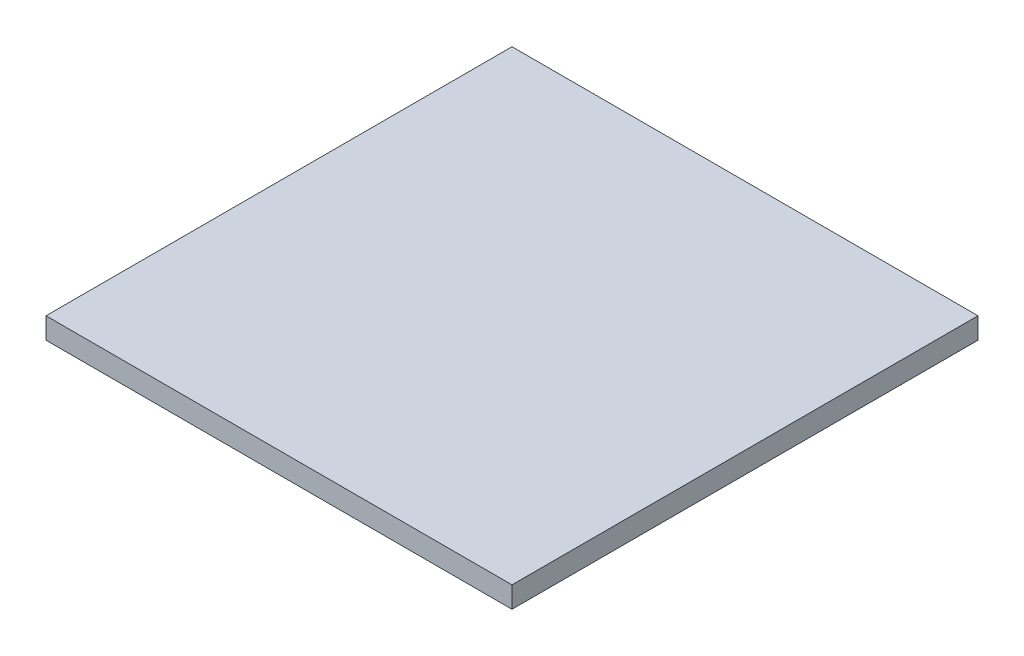
ISO-10303-21;
HEADER;
FILE_DESCRIPTION(('STEP AP214'),'2;1');
FILE_NAME('part.step','',(''),(''),'','','');
FILE_SCHEMA(('AUTOMOTIVE_DESIGN { 1 0 10303 214 1 1 1 1 }'));
ENDSEC;
DATA;
#1=APPLICATION_CONTEXT('core data for automotive mechanical design processes');
#2=APPLICATION_PROTOCOL_DEFINITION('international standard','automotive_design',2000,#1);
#3=PRODUCT_CONTEXT('',#1,'mechanical');
#4=PRODUCT('Part','Part','',(#3));
#5=PRODUCT_RELATED_PRODUCT_CATEGORY('part','',(#4));
#6=PRODUCT_DEFINITION_FORMATION('','',#4);
#7=PRODUCT_DEFINITION_CONTEXT('part definition',#1,'design');
#8=PRODUCT_DEFINITION('design','',#6,#7);
#9=PRODUCT_DEFINITION_SHAPE('','',#8);
#10=(LENGTH_UNIT() NAMED_UNIT(*) SI_UNIT(.MILLI.,.METRE.));
#11=(NAMED_UNIT(*) PLANE_ANGLE_UNIT() SI_UNIT($,.RADIAN.));
#12=(NAMED_UNIT(*) SI_UNIT($,.STERADIAN.) SOLID_ANGLE_UNIT());
#13=UNCERTAINTY_MEASURE_WITH_UNIT(LENGTH_MEASURE(1.E-05),#10,'distance_accuracy_value','');
#14=(GEOMETRIC_REPRESENTATION_CONTEXT(3) GLOBAL_UNCERTAINTY_ASSIGNED_CONTEXT((#13)) GLOBAL_UNIT_ASSIGNED_CONTEXT((#10,
#11,#12)) REPRESENTATION_CONTEXT('',''));
#15=CARTESIAN_POINT('',(0.,0.,0.));
#16=DIRECTION('',(0.,0.,1.));
#17=DIRECTION('',(1.,0.,0.));
#18=AXIS2_PLACEMENT_3D('',#15,#16,#17);
#19=CARTESIAN_POINT('',(0.,12.7,0.));
#20=DIRECTION('',(1.,0.,0.));
#21=DIRECTION('',(0.,0.,-1.));
#22=AXIS2_PLACEMENT_3D('',#19,#20,#21);
#23=PLANE('',#22);
#24=DIRECTION('',(0.,0.,1.));
#25=VECTOR('',#24,1.);
#26=CARTESIAN_POINT('',(0.,0.,0.));
#27=LINE('',#26,#25);
#28=CARTESIAN_POINT('',(0.,0.,-279.4));
#29=VERTEX_POINT('',#28);
#30=CARTESIAN_POINT('',(0.,0.,0.));
#31=VERTEX_POINT('',#30);
#32=EDGE_CURVE('E99',#29,#31,#27,.T.);
#33=ORIENTED_EDGE('',*,*,#32,.T.);
#34=DIRECTION('',(0.,-1.,0.));
#35=VECTOR('',#34,1.);
#36=CARTESIAN_POINT('',(0.,12.7,0.));
#37=LINE('',#36,#35);
#38=CARTESIAN_POINT('',(0.,12.7,0.));
#39=VERTEX_POINT('',#38);
#40=EDGE_CURVE('E11',#39,#31,#37,.T.);
#41=ORIENTED_EDGE('',*,*,#40,.F.);
#42=DIRECTION('',(0.,0.,1.));
#43=VECTOR('',#42,1.);
#44=CARTESIAN_POINT('',(0.,12.7,0.));
#45=LINE('',#44,#43);
#46=CARTESIAN_POINT('',(0.,12.7,-279.4));
#47=VERTEX_POINT('',#46);
#48=EDGE_CURVE('E87',#47,#39,#45,.T.);
#49=ORIENTED_EDGE('',*,*,#48,.F.);
#50=DIRECTION('',(0.,-1.,0.));
#51=VECTOR('',#50,1.);
#52=CARTESIAN_POINT('',(0.,12.7,-279.4));
#53=LINE('',#52,#51);
#54=EDGE_CURVE('E95',#47,#29,#53,.T.);
#55=ORIENTED_EDGE('',*,*,#54,.T.);
#56=EDGE_LOOP('',(#33,#41,#49,#55));
#57=FACE_BOUND('',#56,.T.);
#58=ADVANCED_FACE('F36',(#57),#23,.F.);
#59=CARTESIAN_POINT('',(0.,12.7,0.));
#60=DIRECTION('',(0.,0.,-1.));
#61=DIRECTION('',(-1.,0.,0.));
#62=AXIS2_PLACEMENT_3D('',#59,#60,#61);
#63=PLANE('',#62);
#64=DIRECTION('',(1.,0.,0.));
#65=VECTOR('',#64,1.);
#66=CARTESIAN_POINT('',(0.,0.,0.));
#67=LINE('',#66,#65);
#68=CARTESIAN_POINT('',(279.4,0.,0.));
#69=VERTEX_POINT('',#68);
#70=EDGE_CURVE('E91',#31,#69,#67,.T.);
#71=ORIENTED_EDGE('',*,*,#70,.T.);
#72=DIRECTION('',(0.,-1.,0.));
#73=VECTOR('',#72,1.);
#74=CARTESIAN_POINT('',(279.4,12.7,0.));
#75=LINE('',#74,#73);
#76=CARTESIAN_POINT('',(279.4,12.7,0.));
#77=VERTEX_POINT('',#76);
#78=EDGE_CURVE('E44',#77,#69,#75,.T.);
#79=ORIENTED_EDGE('',*,*,#78,.F.);
#80=DIRECTION('',(1.,0.,0.));
#81=VECTOR('',#80,1.);
#82=CARTESIAN_POINT('',(0.,12.7,0.));
#83=LINE('',#82,#81);
#84=EDGE_CURVE('E82',#39,#77,#83,.T.);
#85=ORIENTED_EDGE('',*,*,#84,.F.);
#86=ORIENTED_EDGE('',*,*,#40,.T.);
#87=EDGE_LOOP('',(#71,#79,#85,#86));
#88=FACE_BOUND('',#87,.T.);
#89=ADVANCED_FACE('F90',(#88),#63,.F.);
#90=CARTESIAN_POINT('',(279.4,12.7,0.));
#91=DIRECTION('',(-1.,0.,0.));
#92=DIRECTION('',(0.,0.,1.));
#93=AXIS2_PLACEMENT_3D('',#90,#91,#92);
#94=PLANE('',#93);
#95=DIRECTION('',(0.,0.,-1.));
#96=VECTOR('',#95,1.);
#97=CARTESIAN_POINT('',(279.4,0.,0.));
#98=LINE('',#97,#96);
#99=CARTESIAN_POINT('',(279.4,0.,-279.4));
#100=VERTEX_POINT('',#99);
#101=EDGE_CURVE('E69',#69,#100,#98,.T.);
#102=ORIENTED_EDGE('',*,*,#101,.T.);
#103=DIRECTION('',(0.,-1.,0.));
#104=VECTOR('',#103,1.);
#105=CARTESIAN_POINT('',(279.4,12.7,-279.4));
#106=LINE('',#105,#104);
#107=CARTESIAN_POINT('',(279.4,12.7,-279.4));
#108=VERTEX_POINT('',#107);
#109=EDGE_CURVE('E92',#108,#100,#106,.T.);
#110=ORIENTED_EDGE('',*,*,#109,.F.);
#111=DIRECTION('',(0.,0.,-1.));
#112=VECTOR('',#111,1.);
#113=CARTESIAN_POINT('',(279.4,12.7,0.));
#114=LINE('',#113,#112);
#115=EDGE_CURVE('E85',#77,#108,#114,.T.);
#116=ORIENTED_EDGE('',*,*,#115,.F.);
#117=ORIENTED_EDGE('',*,*,#78,.T.);
#118=EDGE_LOOP('',(#102,#110,#116,#117));
#119=FACE_BOUND('',#118,.T.);
#120=ADVANCED_FACE('F93',(#119),#94,.F.);
#121=CARTESIAN_POINT('',(0.,12.7,-279.4));
#122=DIRECTION('',(0.,0.,1.));
#123=DIRECTION('',(1.,0.,0.));
#124=AXIS2_PLACEMENT_3D('',#121,#122,#123);
#125=PLANE('',#124);
#126=DIRECTION('',(-1.,0.,0.));
#127=VECTOR('',#126,1.);
#128=CARTESIAN_POINT('',(0.,0.,-279.4));
#129=LINE('',#128,#127);
#130=EDGE_CURVE('E75',#100,#29,#129,.T.);
#131=ORIENTED_EDGE('',*,*,#130,.T.);
#132=ORIENTED_EDGE('',*,*,#54,.F.);
#133=DIRECTION('',(-1.,0.,0.));
#134=VECTOR('',#133,1.);
#135=CARTESIAN_POINT('',(0.,12.7,-279.4));
#136=LINE('',#135,#134);
#137=EDGE_CURVE('E52',#108,#47,#136,.T.);
#138=ORIENTED_EDGE('',*,*,#137,.F.);
#139=ORIENTED_EDGE('',*,*,#109,.T.);
#140=EDGE_LOOP('',(#131,#132,#138,#139));
#141=FACE_BOUND('',#140,.T.);
#142=ADVANCED_FACE('F106',(#141),#125,.F.);
#143=CARTESIAN_POINT('',(0.,12.7,0.));
#144=DIRECTION('',(0.,-1.,0.));
#145=DIRECTION('',(0.,0.,-1.));
#146=AXIS2_PLACEMENT_3D('',#143,#144,#145);
#147=PLANE('',#146);
#148=ORIENTED_EDGE('',*,*,#48,.T.);
#149=ORIENTED_EDGE('',*,*,#84,.T.);
#150=ORIENTED_EDGE('',*,*,#115,.T.);
#151=ORIENTED_EDGE('',*,*,#137,.T.);
#152=EDGE_LOOP('',(#148,#149,#150,#151));
#153=FACE_BOUND('',#152,.T.);
#154=ADVANCED_FACE('F83',(#153),#147,.F.);
#155=CARTESIAN_POINT('',(0.,0.,0.));
#156=DIRECTION('',(0.,-1.,0.));
#157=DIRECTION('',(0.,0.,-1.));
#158=AXIS2_PLACEMENT_3D('',#155,#156,#157);
#159=PLANE('',#158);
#160=ORIENTED_EDGE('',*,*,#32,.F.);
#161=ORIENTED_EDGE('',*,*,#130,.F.);
#162=ORIENTED_EDGE('',*,*,#101,.F.);
#163=ORIENTED_EDGE('',*,*,#70,.F.);
#164=EDGE_LOOP('',(#160,#161,#162,#163));
#165=FACE_BOUND('',#164,.T.);
#166=ADVANCED_FACE('F109',(#165),#159,.T.);
#167=CLOSED_SHELL('',(#58,#89,#120,#142,#154,#166));
#168=MANIFOLD_SOLID_BREP('B2',#167);
#169=ADVANCED_BREP_SHAPE_REPRESENTATION('',(#18,#168),#14);
#170=SHAPE_DEFINITION_REPRESENTATION(#9,#169);
ENDSEC;
END-ISO-10303-21;
